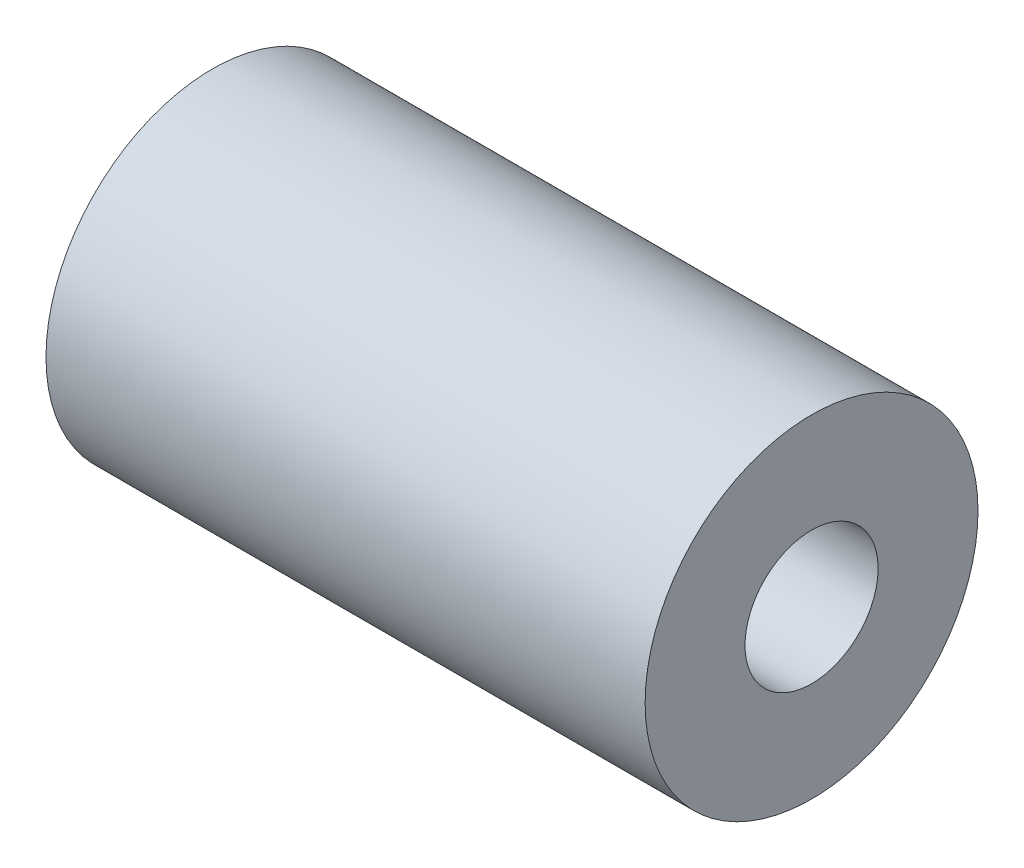
ISO-10303-21;
HEADER;
FILE_DESCRIPTION(('STEP AP214'),'2;1');
FILE_NAME('part.step','',(''),(''),'','','');
FILE_SCHEMA(('AUTOMOTIVE_DESIGN { 1 0 10303 214 1 1 1 1 }'));
ENDSEC;
DATA;
#1=APPLICATION_CONTEXT('core data for automotive mechanical design processes');
#2=APPLICATION_PROTOCOL_DEFINITION('international standard','automotive_design',2000,#1);
#3=PRODUCT_CONTEXT('',#1,'mechanical');
#4=PRODUCT('Part','Part','',(#3));
#5=PRODUCT_RELATED_PRODUCT_CATEGORY('part','',(#4));
#6=PRODUCT_DEFINITION_FORMATION('','',#4);
#7=PRODUCT_DEFINITION_CONTEXT('part definition',#1,'design');
#8=PRODUCT_DEFINITION('design','',#6,#7);
#9=PRODUCT_DEFINITION_SHAPE('','',#8);
#10=(LENGTH_UNIT() NAMED_UNIT(*) SI_UNIT(.MILLI.,.METRE.));
#11=(NAMED_UNIT(*) PLANE_ANGLE_UNIT() SI_UNIT($,.RADIAN.));
#12=(NAMED_UNIT(*) SI_UNIT($,.STERADIAN.) SOLID_ANGLE_UNIT());
#13=UNCERTAINTY_MEASURE_WITH_UNIT(LENGTH_MEASURE(1.E-05),#10,'distance_accuracy_value','');
#14=(GEOMETRIC_REPRESENTATION_CONTEXT(3) GLOBAL_UNCERTAINTY_ASSIGNED_CONTEXT((#13)) GLOBAL_UNIT_ASSIGNED_CONTEXT((#10,
#11,#12)) REPRESENTATION_CONTEXT('',''));
#15=CARTESIAN_POINT('',(0.,0.,0.));
#16=DIRECTION('',(0.,0.,1.));
#17=DIRECTION('',(1.,0.,0.));
#18=AXIS2_PLACEMENT_3D('',#15,#16,#17);
#19=CARTESIAN_POINT('',(45.,197.985030246612,154.076780332577));
#20=DIRECTION('',(1.,0.,0.));
#21=DIRECTION('',(0.,0.,-1.));
#22=AXIS2_PLACEMENT_3D('',#19,#20,#21);
#23=PLANE('',#22);
#24=CARTESIAN_POINT('',(45.,197.985030246612,154.076780332577));
#25=DIRECTION('',(1.,0.,0.));
#26=DIRECTION('',(0.,0.,-1.));
#27=AXIS2_PLACEMENT_3D('',#24,#25,#26);
#28=CIRCLE('',#27,25.);
#29=CARTESIAN_POINT('',(45.,197.985030246612,129.076780332577));
#30=VERTEX_POINT('',#29);
#31=EDGE_CURVE('E10',#30,#30,#28,.T.);
#32=ORIENTED_EDGE('',*,*,#31,.T.);
#33=EDGE_LOOP('',(#32));
#34=FACE_BOUND('',#33,.T.);
#35=CARTESIAN_POINT('',(45.,197.985030246612,154.076780332577));
#36=DIRECTION('',(1.,0.,0.));
#37=DIRECTION('',(0.,0.,-1.));
#38=AXIS2_PLACEMENT_3D('',#35,#36,#37);
#39=CIRCLE('',#38,10.);
#40=CARTESIAN_POINT('',(45.,197.985030246612,144.076780332577));
#41=VERTEX_POINT('',#40);
#42=EDGE_CURVE('E44',#41,#41,#39,.T.);
#43=ORIENTED_EDGE('',*,*,#42,.F.);
#44=EDGE_LOOP('',(#43));
#45=FACE_BOUND('',#44,.T.);
#46=ADVANCED_FACE('F32',(#34,#45),#23,.T.);
#47=CARTESIAN_POINT('',(-45.,197.985030246612,154.076780332577));
#48=DIRECTION('',(1.,0.,0.));
#49=DIRECTION('',(0.,0.,-1.));
#50=AXIS2_PLACEMENT_3D('',#47,#48,#49);
#51=PLANE('',#50);
#52=CARTESIAN_POINT('',(-45.,197.985030246612,154.076780332577));
#53=DIRECTION('',(1.,0.,0.));
#54=DIRECTION('',(0.,0.,-1.));
#55=AXIS2_PLACEMENT_3D('',#52,#53,#54);
#56=CIRCLE('',#55,25.);
#57=CARTESIAN_POINT('',(-45.,197.985030246612,129.076780332577));
#58=VERTEX_POINT('',#57);
#59=EDGE_CURVE('E37',#58,#58,#56,.T.);
#60=ORIENTED_EDGE('',*,*,#59,.F.);
#61=EDGE_LOOP('',(#60));
#62=FACE_BOUND('',#61,.T.);
#63=CARTESIAN_POINT('',(-45.,197.985030246612,154.076780332577));
#64=DIRECTION('',(1.,0.,0.));
#65=DIRECTION('',(0.,0.,-1.));
#66=AXIS2_PLACEMENT_3D('',#63,#64,#65);
#67=CIRCLE('',#66,10.);
#68=CARTESIAN_POINT('',(-45.,197.985030246612,144.076780332577));
#69=VERTEX_POINT('',#68);
#70=EDGE_CURVE('E46',#69,#69,#67,.T.);
#71=ORIENTED_EDGE('',*,*,#70,.T.);
#72=EDGE_LOOP('',(#71));
#73=FACE_BOUND('',#72,.T.);
#74=ADVANCED_FACE('F73',(#62,#73),#51,.F.);
#75=CARTESIAN_POINT('',(45.,197.985030246612,154.076780332577));
#76=DIRECTION('',(-1.,0.,0.));
#77=DIRECTION('',(0.,0.,1.));
#78=AXIS2_PLACEMENT_3D('',#75,#76,#77);
#79=CYLINDRICAL_SURFACE('',#78,25.);
#80=CARTESIAN_POINT('',(0.,203.744377317244,129.749225557795));
#81=CARTESIAN_POINT('',(-0.190029576338668,203.744369646465,129.74922187094));
#82=CARTESIAN_POINT('',(-0.380174394766199,203.728677724756,129.745492267119));
#83=CARTESIAN_POINT('',(-0.755162056742349,203.666315748231,129.730857032483));
#84=CARTESIAN_POINT('',(-0.939999314933101,203.619614223462,129.71994411181));
#85=CARTESIAN_POINT('',(-1.29888893759892,203.496591912482,129.691812756744));
#86=CARTESIAN_POINT('',(-1.47294891807803,203.420292325938,129.67459883595));
#87=CARTESIAN_POINT('',(-1.80554769388031,203.240208032198,129.635185403624));
#88=CARTESIAN_POINT('',(-1.96408892041336,203.136427639689,129.612986674826));
#89=CARTESIAN_POINT('',(-2.26222561954883,202.903497037231,129.565092008711));
#90=CARTESIAN_POINT('',(-2.40170378886522,202.774200752715,129.539376209899));
#91=CARTESIAN_POINT('',(-2.65674043356096,202.494113136045,129.486366634652));
#92=CARTESIAN_POINT('',(-2.77229766776323,202.343320689213,129.45907277643));
#93=CARTESIAN_POINT('',(-2.97663841152072,202.023683869725,129.404617423866));
#94=CARTESIAN_POINT('',(-3.06531491860746,201.854770883827,129.377456871227));
#95=CARTESIAN_POINT('',(-3.21269111738586,201.50405987745,129.325056545797));
#96=CARTESIAN_POINT('',(-3.27139211787124,201.32226241993,129.299816689184));
#97=CARTESIAN_POINT('',(-3.35679820607727,200.952075221354,129.252775324257));
#98=CARTESIAN_POINT('',(-3.38369900432921,200.763733225445,129.230953509153));
#99=CARTESIAN_POINT('',(-3.40534809438424,200.38478110109,129.191493998367));
#100=CARTESIAN_POINT('',(-3.40009786983086,200.194171077711,129.173856109651));
#101=CARTESIAN_POINT('',(-3.35774978826167,199.817428312343,129.143312584351));
#102=CARTESIAN_POINT('',(-3.3208624412004,199.631274317934,129.130376470961));
#103=CARTESIAN_POINT('',(-3.21661685120555,199.267434184955,129.109027676821));
#104=CARTESIAN_POINT('',(-3.14925794088873,199.089748231946,129.100615095153));
#105=CARTESIAN_POINT('',(-2.98576094300858,198.747310484208,129.087814547128));
#106=CARTESIAN_POINT('',(-2.88953279521515,198.582601231939,129.083439352452));
#107=CARTESIAN_POINT('',(-2.67109449376752,198.271356796252,129.077934671536));
#108=CARTESIAN_POINT('',(-2.5488829309914,198.124822599177,129.076805361373));
#109=CARTESIAN_POINT('',(-2.28077051201466,197.852946537906,129.07675587953));
#110=CARTESIAN_POINT('',(-2.13468604731019,197.727785667346,129.077853649654));
#111=CARTESIAN_POINT('',(-1.82360244734938,197.503734678298,129.081161728235));
#112=CARTESIAN_POINT('',(-1.65860323140929,197.40484467188,129.083372041438));
#113=CARTESIAN_POINT('',(-1.31420032009171,197.236221400947,129.08785400564));
#114=CARTESIAN_POINT('',(-1.13478860897868,197.166504497217,129.090125690299));
#115=CARTESIAN_POINT('',(-0.766745528362031,197.058451498423,129.093898151335));
#116=CARTESIAN_POINT('',(-0.578114688868446,197.020113601615,129.095398971973));
#117=CARTESIAN_POINT('',(-0.198599192235644,196.976196130856,129.097133803055));
#118=CARTESIAN_POINT('',(-0.00774451988469916,196.970357664809,129.097377824058));
#119=CARTESIAN_POINT('',(0.372211905983791,196.990926593324,129.09655095577));
#120=CARTESIAN_POINT('',(0.561313703810253,197.017333170548,129.095480099807));
#121=CARTESIAN_POINT('',(0.931616251737915,197.101394625896,129.092366646109));
#122=CARTESIAN_POINT('',(1.11284585681686,197.158922725275,129.090327994948));
#123=CARTESIAN_POINT('',(1.46316530128007,197.30340248689,129.085970496639));
#124=CARTESIAN_POINT('',(1.63225464043385,197.390355360709,129.083651637955));
#125=CARTESIAN_POINT('',(1.95465084149717,197.591760613697,129.07967032458));
#126=CARTESIAN_POINT('',(2.10785289413236,197.706380824105,129.078012046283));
#127=CARTESIAN_POINT('',(2.39305292823801,197.959527408787,129.076473713223));
#128=CARTESIAN_POINT('',(2.5250499291011,198.098054888015,129.076593740672));
#129=CARTESIAN_POINT('',(2.76500325371818,198.396107850383,129.079713827228));
#130=CARTESIAN_POINT('',(2.87279026592291,198.555769515698,129.082733435075));
#131=CARTESIAN_POINT('',(3.06008904651431,198.890789781336,129.092632471805));
#132=CARTESIAN_POINT('',(3.13960147251546,199.066148016466,129.099511810908));
#133=CARTESIAN_POINT('',(3.26781819564848,199.42695456768,129.117746837568));
#134=CARTESIAN_POINT('',(3.31661812596686,199.612369590221,129.129088449334));
#135=CARTESIAN_POINT('',(3.38233508626216,199.988426742006,129.156468874281));
#136=CARTESIAN_POINT('',(3.39925383209013,200.179068589381,129.172507434618));
#137=CARTESIAN_POINT('',(3.40069199713389,200.558508004685,129.208864284153));
#138=CARTESIAN_POINT('',(3.38547163129403,200.747308046008,129.229147012025));
#139=CARTESIAN_POINT('',(3.32361752124096,201.119251958268,129.273318060809));
#140=CARTESIAN_POINT('',(3.27698382892593,201.302395838549,129.297206375766));
#141=CARTESIAN_POINT('',(3.15371308012981,201.657828750691,129.347389385137));
#142=CARTESIAN_POINT('',(3.07709084034669,201.830123094349,129.373682886293));
#143=CARTESIAN_POINT('',(2.89604517799147,202.159268679527,129.427164319241));
#144=CARTESIAN_POINT('',(2.79162118181744,202.316119602331,129.454352269478));
#145=CARTESIAN_POINT('',(2.55698218940722,202.611330181461,129.508099656228));
#146=CARTESIAN_POINT('',(2.4265740964655,202.749537552301,129.534652610991));
#147=CARTESIAN_POINT('',(2.1440732533698,203.002326248835,129.585079689766));
#148=CARTESIAN_POINT('',(1.99197539820735,203.1169019969,129.608953180757));
#149=CARTESIAN_POINT('',(1.66960398272919,203.319737206978,129.652371591216));
#150=CARTESIAN_POINT('',(1.4992504283827,203.407873835227,129.671896201367));
#151=CARTESIAN_POINT('',(1.14585264176604,203.55457357827,129.704954553435));
#152=CARTESIAN_POINT('',(0.962822187421352,203.613168244509,129.718494684986));
#153=CARTESIAN_POINT('',(0.649078939278955,203.685462443675,129.73533560501));
#154=CARTESIAN_POINT('',(0.520328985100017,203.707523983112,129.740525549326));
#155=CARTESIAN_POINT('',(0.261070809599467,203.736983984274,129.747471775697));
#156=CARTESIAN_POINT('',(0.130562605265498,203.744382587566,129.749228090903));
#157=CARTESIAN_POINT('',(0.,203.744377317244,129.749225557795));
#158=B_SPLINE_CURVE_WITH_KNOTS('',3,(#80,#81,#82,#83,#84,#85,#86,#87,#88,#89,#90,#91,#92,#93,
#94,#95,#96,#97,#98,#99,#100,#101,#102,#103,#104,#105,#106,#107,#108,#109,#110,#111,#112,#113,
#114,#115,#116,#117,#118,#119,#120,#121,#122,#123,#124,#125,#126,#127,#128,#129,#130,#131,#132,
#133,#134,#135,#136,#137,#138,#139,#140,#141,#142,#143,#144,#145,#146,#147,#148,#149,#150,#151,
#152,#153,#154,#155,#156,#157),.UNSPECIFIED.,.T.,.F.,(4,2,2,2,2,2,2,2,2,2,2,2,2,2,2,2,2,2,2,2,2,
2,2,2,2,2,2,2,2,2,2,2,2,2,2,2,2,2,4),(0.,0.569611660088493,1.13980227325693,1.70958523815835,
2.2792787959756,2.85233366942242,3.42541826931536,4.00075502876456,4.57606666565155,
5.14781887091611,5.7195446922589,6.28749556689725,6.8554588813059,7.42521276624384,
7.99499755772633,8.56939087511832,9.14378664276348,9.71850411125342,10.2931885778661,
10.8632884559221,11.4333738835579,12.0011542705008,12.5689580389959,13.1402967362591,
13.7116618469338,14.286906299978,14.8621373730266,15.435568300786,16.0089683655088,
16.577743693807,17.1465180824297,17.7150118058674,18.2835172592965,18.8564165993951,
19.429451003119,20.005107847823,20.5801485693988,20.9715123865198,21.3628724251183),.UNSPECIFIED.);
#159=CARTESIAN_POINT('',(0.,203.744377317244,129.749225557795));
#160=VERTEX_POINT('',#159);
#161=EDGE_CURVE('E49',#160,#160,#158,.T.);
#162=ORIENTED_EDGE('',*,*,#161,.T.);
#163=EDGE_LOOP('',(#162));
#164=FACE_BOUND('',#163,.T.);
#165=ORIENTED_EDGE('',*,*,#31,.F.);
#166=EDGE_LOOP('',(#165));
#167=FACE_BOUND('',#166,.T.);
#168=ORIENTED_EDGE('',*,*,#59,.T.);
#169=EDGE_LOOP('',(#168));
#170=FACE_BOUND('',#169,.T.);
#171=ADVANCED_FACE('F34',(#164,#167,#170),#79,.T.);
#172=CARTESIAN_POINT('',(45.,197.985030246612,154.076780332577));
#173=DIRECTION('',(-1.,0.,0.));
#174=DIRECTION('',(0.,0.,1.));
#175=AXIS2_PLACEMENT_3D('',#172,#173,#174);
#176=CYLINDRICAL_SURFACE('',#175,10.);
#177=CARTESIAN_POINT('',(0.,202.271150792769,145.041894020961));
#178=CARTESIAN_POINT('',(-0.184953420483386,202.271152328306,145.041895487486));
#179=CARTESIAN_POINT('',(-0.369895511118664,202.25660691063,145.034951587327));
#180=CARTESIAN_POINT('',(-0.734285524505217,202.198968766825,145.007948348507));
#181=CARTESIAN_POINT('',(-0.913732720692542,202.155872282431,144.987887283198));
#182=CARTESIAN_POINT('',(-1.26179216911297,202.042700851751,144.936806717043));
#183=CARTESIAN_POINT('',(-1.43042555412141,201.972680519812,144.905809410514));
#184=CARTESIAN_POINT('',(-1.75316390833697,201.807644775855,144.835805031876));
#185=CARTESIAN_POINT('',(-1.9072654620899,201.712623507592,144.796796083583));
#186=CARTESIAN_POINT('',(-2.20284172907644,201.495903489572,144.712606833003));
#187=CARTESIAN_POINT('',(-2.3436386959309,201.373348093802,144.667251650169));
#188=CARTESIAN_POINT('',(-2.60251129740334,201.106539829283,144.57540880306));
#189=CARTESIAN_POINT('',(-2.72058311483183,200.962283322593,144.528920950003));
#190=CARTESIAN_POINT('',(-2.93375754891917,200.651046144151,144.43731233454));
#191=CARTESIAN_POINT('',(-3.02814598687085,200.48355305909,144.392263424073));
#192=CARTESIAN_POINT('',(-3.1865408088908,200.133282380161,144.308598645677));
#193=CARTESIAN_POINT('',(-3.2505557338234,199.950509100023,144.269980971303));
#194=CARTESIAN_POINT('',(-3.34407614799038,199.581711099604,144.20335952027));
#195=CARTESIAN_POINT('',(-3.37474354767115,199.396041697774,144.175023028059));
#196=CARTESIAN_POINT('',(-3.40439717563339,199.020931324853,144.128786527992));
#197=CARTESIAN_POINT('',(-3.40339189225255,198.831491377876,144.110883725196));
#198=CARTESIAN_POINT('',(-3.37045649771205,198.462445660843,144.086539873932));
#199=CARTESIAN_POINT('',(-3.33978930884827,198.282753917918,144.079661143757));
#200=CARTESIAN_POINT('',(-3.25049458616494,197.930359859458,144.075376448254));
#201=CARTESIAN_POINT('',(-3.1918651387634,197.75765802315,144.077971131315));
#202=CARTESIAN_POINT('',(-3.04759669596914,197.421550161065,144.091231691569));
#203=CARTESIAN_POINT('',(-2.96160609055152,197.258299824226,144.102005322788));
#204=CARTESIAN_POINT('',(-2.7653489914145,196.947655742136,144.129508915594));
#205=CARTESIAN_POINT('',(-2.6550755595568,196.800266546718,144.146240580365));
#206=CARTESIAN_POINT('',(-2.40706037588067,196.518115630512,144.18388320162));
#207=CARTESIAN_POINT('',(-2.2682397857551,196.384322737207,144.204958413567));
#208=CARTESIAN_POINT('',(-1.97029791012479,196.141642147697,144.247378800897));
#209=CARTESIAN_POINT('',(-1.81117323414375,196.03275861948,144.26872402083));
#210=CARTESIAN_POINT('',(-1.47392005703156,195.841782129331,144.308659248446));
#211=CARTESIAN_POINT('',(-1.29553720080067,195.760126356284,144.327201900445));
#212=CARTESIAN_POINT('',(-0.926795423318459,195.629068343952,144.358034015579));
#213=CARTESIAN_POINT('',(-0.736441805910877,195.579651929344,144.370326226445));
#214=CARTESIAN_POINT('',(-0.358687922972768,195.516724383083,144.386141763946));
#215=CARTESIAN_POINT('',(-0.171565151773505,195.501643665056,144.390047931123));
#216=CARTESIAN_POINT('',(0.202499236177578,195.503402078571,144.389596544125));
#217=CARTESIAN_POINT('',(0.389440880724189,195.520235107942,144.38524056974));
#218=CARTESIAN_POINT('',(0.750767104370265,195.583877420471,144.369285199455));
#219=CARTESIAN_POINT('',(0.925361233510363,195.629578240386,144.357954029978));
#220=CARTESIAN_POINT('',(1.26457943002345,195.748195839726,144.329972673476));
#221=CARTESIAN_POINT('',(1.42920167910262,195.82111756541,144.313321519845));
#222=CARTESIAN_POINT('',(1.74976750453815,195.994628460217,144.276454301047));
#223=CARTESIAN_POINT('',(1.90525172592363,196.096043830703,144.256139527613));
#224=CARTESIAN_POINT('',(2.19795097623299,196.322480704157,144.215282221154));
#225=CARTESIAN_POINT('',(2.33516038994051,196.447509434289,144.194739620217));
#226=CARTESIAN_POINT('',(2.59456383577249,196.724841356924,144.155466176248));
#227=CARTESIAN_POINT('',(2.71565315524019,196.878201285909,144.136878747033));
#228=CARTESIAN_POINT('',(2.93087671469155,197.203395378734,144.106038925678));
#229=CARTESIAN_POINT('',(3.02501179224384,197.3752289683,144.093786336681));
#230=CARTESIAN_POINT('',(3.18281762815213,197.731494432386,144.07841674754));
#231=CARTESIAN_POINT('',(3.24667641013146,197.915840201012,144.075242730217));
#232=CARTESIAN_POINT('',(3.34240109335653,198.292519876081,144.079737651272));
#233=CARTESIAN_POINT('',(3.37427906347886,198.484850740561,144.087402496661));
#234=CARTESIAN_POINT('',(3.40401677937448,198.86188691147,144.113593257837));
#235=CARTESIAN_POINT('',(3.40345955105111,199.046506734429,144.131571331189));
#236=CARTESIAN_POINT('',(3.37227320513029,199.411923234213,144.177392654875));
#237=CARTESIAN_POINT('',(3.34164669532399,199.592720241188,144.205235049581));
#238=CARTESIAN_POINT('',(3.25225312728203,199.942359133093,144.268624184688));
#239=CARTESIAN_POINT('',(3.19397575139754,200.111352489475,144.304031180705));
#240=CARTESIAN_POINT('',(3.0513926574057,200.436583924105,144.380501463688));
#241=CARTESIAN_POINT('',(2.96708217172728,200.592819659353,144.421565785945));
#242=CARTESIAN_POINT('',(2.77115750937565,200.89472438054,144.508118820191));
#243=CARTESIAN_POINT('',(2.65863042840571,201.039769326242,144.553716181046));
#244=CARTESIAN_POINT('',(2.41100145759273,201.309330271422,144.644426785497));
#245=CARTESIAN_POINT('',(2.27589221921548,201.433839562037,144.6895398664));
#246=CARTESIAN_POINT('',(1.980285541935,201.664262248138,144.777366367333));
#247=CARTESIAN_POINT('',(1.81897160206546,201.769198455493,144.819904410258));
#248=CARTESIAN_POINT('',(1.47938230695657,201.951058770259,144.896344883552));
#249=CARTESIAN_POINT('',(1.30111053313024,202.027988775951,144.930249131799));
#250=CARTESIAN_POINT('',(0.938348484386958,202.149459294438,144.984923676048));
#251=CARTESIAN_POINT('',(0.754235973509107,202.194951591368,145.006077183894));
#252=CARTESIAN_POINT('',(0.380076784731453,202.255790768748,145.034558950813));
#253=CARTESIAN_POINT('',(0.190032412041659,202.271149215066,145.041892514164));
#254=CARTESIAN_POINT('',(0.,202.271150792769,145.041894020961));
#255=B_SPLINE_CURVE_WITH_KNOTS('',3,(#177,#178,#179,#180,#181,#182,#183,#184,#185,#186,#187,
#188,#189,#190,#191,#192,#193,#194,#195,#196,#197,#198,#199,#200,#201,#202,#203,#204,#205,#206,
#207,#208,#209,#210,#211,#212,#213,#214,#215,#216,#217,#218,#219,#220,#221,#222,#223,#224,#225,
#226,#227,#228,#229,#230,#231,#232,#233,#234,#235,#236,#237,#238,#239,#240,#241,#242,#243,#244,
#245,#246,#247,#248,#249,#250,#251,#252,#253,#254),.UNSPECIFIED.,.T.,.F.,(4,2,2,2,2,2,2,2,2,2,2,
2,2,2,2,2,2,2,2,2,2,2,2,2,2,2,2,2,2,2,2,2,2,2,2,2,2,2,4),(0.,0.554155936307698,1.10838483238169,
1.66149536988461,2.21473558407243,2.78843620567122,3.36223310898808,3.95167753488278,
4.54095611388204,5.10897071265915,5.67683308376738,6.22153553621665,6.76627527043253,
7.31831900527051,7.870520676295,8.449702653461,9.02898147216675,9.61715795470347,
10.2050756473345,10.765526658763,11.3258705181362,11.8659072222684,12.4060421032449,
12.963826432496,13.5217817561254,14.1078464903067,14.6938930112979,15.2762507491976,
15.8583886349396,16.4121398132911,16.9658429712109,17.5100868450773,18.0544304481671,
18.6193838234414,19.1845214012714,19.7729365795803,20.3612277621791,20.9308199934135,
21.5001935629778),.UNSPECIFIED.);
#256=CARTESIAN_POINT('',(0.,202.271150792769,145.041894020961));
#257=VERTEX_POINT('',#256);
#258=EDGE_CURVE('E57',#257,#257,#255,.T.);
#259=ORIENTED_EDGE('',*,*,#258,.F.);
#260=EDGE_LOOP('',(#259));
#261=FACE_BOUND('',#260,.T.);
#262=ORIENTED_EDGE('',*,*,#42,.T.);
#263=EDGE_LOOP('',(#262));
#264=FACE_BOUND('',#263,.T.);
#265=ORIENTED_EDGE('',*,*,#70,.F.);
#266=EDGE_LOOP('',(#265));
#267=FACE_BOUND('',#266,.T.);
#268=ADVANCED_FACE('F64',(#261,#264,#267),#176,.F.);
#269=CARTESIAN_POINT('',(0.,200.382318836311,129.191985629431));
#270=DIRECTION('',(0.,0.0958915435879377,-0.995391788125824));
#271=DIRECTION('',(0.,0.995391788125824,0.0958915435879377));
#272=AXIS2_PLACEMENT_3D('',#269,#270,#271);
#273=CYLINDRICAL_SURFACE('',#272,3.39999999999998);
#274=ORIENTED_EDGE('',*,*,#258,.T.);
#275=EDGE_LOOP('',(#274));
#276=FACE_BOUND('',#275,.T.);
#277=ORIENTED_EDGE('',*,*,#161,.F.);
#278=EDGE_LOOP('',(#277));
#279=FACE_BOUND('',#278,.T.);
#280=ADVANCED_FACE('F61',(#276,#279),#273,.F.);
#281=CLOSED_SHELL('',(#46,#74,#171,#268,#280));
#282=MANIFOLD_SOLID_BREP('B2',#281);
#283=ADVANCED_BREP_SHAPE_REPRESENTATION('',(#18,#282),#14);
#284=SHAPE_DEFINITION_REPRESENTATION(#9,#283);
ENDSEC;
END-ISO-10303-21;
